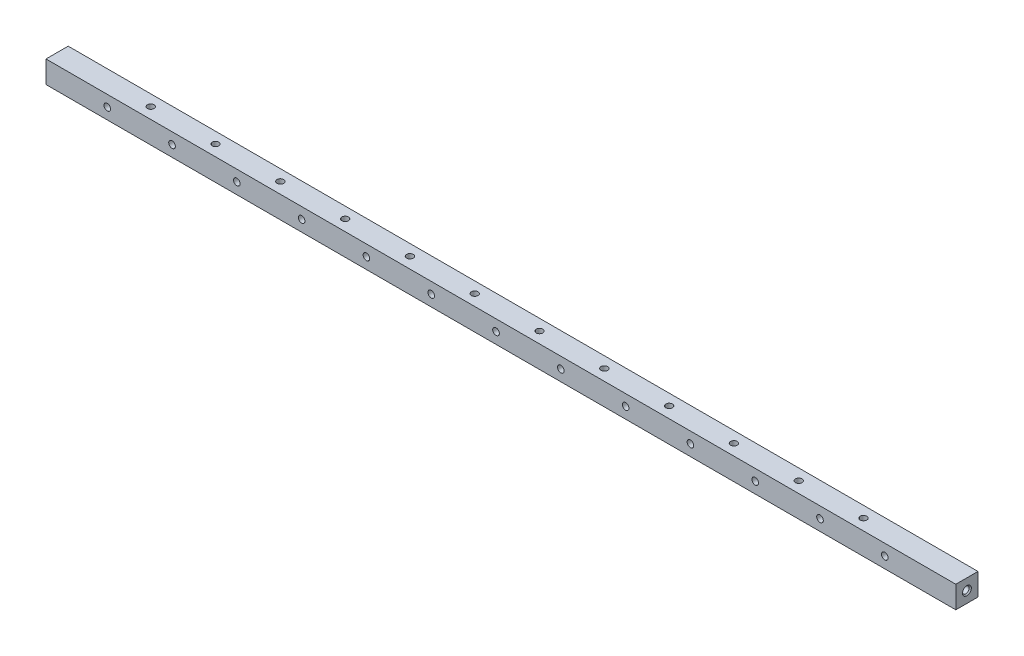
ISO-10303-21;
HEADER;
FILE_DESCRIPTION(('STEP AP214'),'2;1');
FILE_NAME('part.step','',(''),(''),'','','');
FILE_SCHEMA(('AUTOMOTIVE_DESIGN { 1 0 10303 214 1 1 1 1 }'));
ENDSEC;
DATA;
#1=APPLICATION_CONTEXT('core data for automotive mechanical design processes');
#2=APPLICATION_PROTOCOL_DEFINITION('international standard','automotive_design',2000,#1);
#3=PRODUCT_CONTEXT('',#1,'mechanical');
#4=PRODUCT('Part','Part','',(#3));
#5=PRODUCT_RELATED_PRODUCT_CATEGORY('part','',(#4));
#6=PRODUCT_DEFINITION_FORMATION('','',#4);
#7=PRODUCT_DEFINITION_CONTEXT('part definition',#1,'design');
#8=PRODUCT_DEFINITION('design','',#6,#7);
#9=PRODUCT_DEFINITION_SHAPE('','',#8);
#10=(LENGTH_UNIT() NAMED_UNIT(*) SI_UNIT(.MILLI.,.METRE.));
#11=(NAMED_UNIT(*) PLANE_ANGLE_UNIT() SI_UNIT($,.RADIAN.));
#12=(NAMED_UNIT(*) SI_UNIT($,.STERADIAN.) SOLID_ANGLE_UNIT());
#13=UNCERTAINTY_MEASURE_WITH_UNIT(LENGTH_MEASURE(1.E-05),#10,'distance_accuracy_value','');
#14=(GEOMETRIC_REPRESENTATION_CONTEXT(3) GLOBAL_UNCERTAINTY_ASSIGNED_CONTEXT((#13)) GLOBAL_UNIT_ASSIGNED_CONTEXT((#10,
#11,#12)) REPRESENTATION_CONTEXT('',''));
#15=CARTESIAN_POINT('',(0.,0.,0.));
#16=DIRECTION('',(0.,0.,1.));
#17=DIRECTION('',(1.,0.,0.));
#18=AXIS2_PLACEMENT_3D('',#15,#16,#17);
#19=CARTESIAN_POINT('',(520.7,6.35,-6.35));
#20=DIRECTION('',(0.,-1.,0.));
#21=DIRECTION('',(0.,0.,-1.));
#22=AXIS2_PLACEMENT_3D('',#19,#20,#21);
#23=PLANE('',#22);
#24=CARTESIAN_POINT('',(461.518,6.35,0.));
#25=DIRECTION('',(0.,1.,0.));
#26=DIRECTION('',(0.,0.,1.));
#27=AXIS2_PLACEMENT_3D('',#24,#25,#26);
#28=CIRCLE('',#27,1.89865);
#29=CARTESIAN_POINT('',(461.518,6.35,1.89865));
#30=VERTEX_POINT('',#29);
#31=EDGE_CURVE('E709',#30,#30,#28,.T.);
#32=ORIENTED_EDGE('',*,*,#31,.F.);
#33=EDGE_LOOP('',(#32));
#34=FACE_BOUND('',#33,.T.);
#35=CARTESIAN_POINT('',(387.35,6.35,0.));
#36=DIRECTION('',(0.,1.,0.));
#37=DIRECTION('',(0.,0.,1.));
#38=AXIS2_PLACEMENT_3D('',#35,#36,#37);
#39=CIRCLE('',#38,1.89865);
#40=CARTESIAN_POINT('',(387.35,6.35,1.89865));
#41=VERTEX_POINT('',#40);
#42=EDGE_CURVE('E705',#41,#41,#39,.T.);
#43=ORIENTED_EDGE('',*,*,#42,.F.);
#44=EDGE_LOOP('',(#43));
#45=FACE_BOUND('',#44,.T.);
#46=CARTESIAN_POINT('',(350.266,6.35,0.));
#47=DIRECTION('',(0.,1.,0.));
#48=DIRECTION('',(0.,0.,1.));
#49=AXIS2_PLACEMENT_3D('',#46,#47,#48);
#50=CIRCLE('',#49,1.89865);
#51=CARTESIAN_POINT('',(350.266,6.35,1.89865));
#52=VERTEX_POINT('',#51);
#53=EDGE_CURVE('E719',#52,#52,#50,.T.);
#54=ORIENTED_EDGE('',*,*,#53,.F.);
#55=EDGE_LOOP('',(#54));
#56=FACE_BOUND('',#55,.T.);
#57=CARTESIAN_POINT('',(313.182,6.35,0.));
#58=DIRECTION('',(0.,1.,0.));
#59=DIRECTION('',(0.,0.,1.));
#60=AXIS2_PLACEMENT_3D('',#57,#58,#59);
#61=CIRCLE('',#60,1.89865);
#62=CARTESIAN_POINT('',(313.182,6.35,1.89865));
#63=VERTEX_POINT('',#62);
#64=EDGE_CURVE('E727',#63,#63,#61,.T.);
#65=ORIENTED_EDGE('',*,*,#64,.F.);
#66=EDGE_LOOP('',(#65));
#67=FACE_BOUND('',#66,.T.);
#68=CARTESIAN_POINT('',(239.014,6.35,0.));
#69=DIRECTION('',(0.,1.,0.));
#70=DIRECTION('',(0.,0.,1.));
#71=AXIS2_PLACEMENT_3D('',#68,#69,#70);
#72=CIRCLE('',#71,1.89865);
#73=CARTESIAN_POINT('',(239.014,6.35,1.89865));
#74=VERTEX_POINT('',#73);
#75=EDGE_CURVE('E741',#74,#74,#72,.T.);
#76=ORIENTED_EDGE('',*,*,#75,.F.);
#77=EDGE_LOOP('',(#76));
#78=FACE_BOUND('',#77,.T.);
#79=CARTESIAN_POINT('',(201.93,6.35,0.));
#80=DIRECTION('',(0.,1.,0.));
#81=DIRECTION('',(0.,0.,1.));
#82=AXIS2_PLACEMENT_3D('',#79,#80,#81);
#83=CIRCLE('',#82,1.89865);
#84=CARTESIAN_POINT('',(201.93,6.35,1.89865));
#85=VERTEX_POINT('',#84);
#86=EDGE_CURVE('E749',#85,#85,#83,.T.);
#87=ORIENTED_EDGE('',*,*,#86,.F.);
#88=EDGE_LOOP('',(#87));
#89=FACE_BOUND('',#88,.T.);
#90=CARTESIAN_POINT('',(164.846,6.35,0.));
#91=DIRECTION('',(0.,1.,0.));
#92=DIRECTION('',(0.,0.,1.));
#93=AXIS2_PLACEMENT_3D('',#90,#91,#92);
#94=CIRCLE('',#93,1.89865);
#95=CARTESIAN_POINT('',(164.846,6.35,1.89865));
#96=VERTEX_POINT('',#95);
#97=EDGE_CURVE('E757',#96,#96,#94,.T.);
#98=ORIENTED_EDGE('',*,*,#97,.F.);
#99=EDGE_LOOP('',(#98));
#100=FACE_BOUND('',#99,.T.);
#101=CARTESIAN_POINT('',(127.762,6.35,0.));
#102=DIRECTION('',(0.,1.,0.));
#103=DIRECTION('',(0.,0.,1.));
#104=AXIS2_PLACEMENT_3D('',#101,#102,#103);
#105=CIRCLE('',#104,1.89865);
#106=CARTESIAN_POINT('',(127.762,6.35,1.89865));
#107=VERTEX_POINT('',#106);
#108=EDGE_CURVE('E765',#107,#107,#105,.T.);
#109=ORIENTED_EDGE('',*,*,#108,.F.);
#110=EDGE_LOOP('',(#109));
#111=FACE_BOUND('',#110,.T.);
#112=CARTESIAN_POINT('',(90.678,6.35,0.));
#113=DIRECTION('',(0.,1.,0.));
#114=DIRECTION('',(0.,0.,1.));
#115=AXIS2_PLACEMENT_3D('',#112,#113,#114);
#116=CIRCLE('',#115,1.89864999999999);
#117=CARTESIAN_POINT('',(90.678,6.35,1.89864999999999));
#118=VERTEX_POINT('',#117);
#119=EDGE_CURVE('E773',#118,#118,#116,.T.);
#120=ORIENTED_EDGE('',*,*,#119,.F.);
#121=EDGE_LOOP('',(#120));
#122=FACE_BOUND('',#121,.T.);
#123=CARTESIAN_POINT('',(53.594,6.35,0.));
#124=DIRECTION('',(0.,1.,0.));
#125=DIRECTION('',(0.,0.,1.));
#126=AXIS2_PLACEMENT_3D('',#123,#124,#125);
#127=CIRCLE('',#126,1.89864999999999);
#128=CARTESIAN_POINT('',(53.594,6.35,1.89864999999999));
#129=VERTEX_POINT('',#128);
#130=EDGE_CURVE('E138',#129,#129,#127,.T.);
#131=ORIENTED_EDGE('',*,*,#130,.F.);
#132=EDGE_LOOP('',(#131));
#133=FACE_BOUND('',#132,.T.);
#134=DIRECTION('',(0.,0.,1.));
#135=VECTOR('',#134,1.);
#136=CARTESIAN_POINT('',(0.,6.35,-6.35));
#137=LINE('',#136,#135);
#138=CARTESIAN_POINT('',(0.,6.35,-6.35));
#139=VERTEX_POINT('',#138);
#140=CARTESIAN_POINT('',(0.,6.35,6.35));
#141=VERTEX_POINT('',#140);
#142=EDGE_CURVE('E90',#139,#141,#137,.T.);
#143=ORIENTED_EDGE('',*,*,#142,.T.);
#144=DIRECTION('',(-1.,0.,0.));
#145=VECTOR('',#144,1.);
#146=CARTESIAN_POINT('',(520.7,6.35,6.35));
#147=LINE('',#146,#145);
#148=CARTESIAN_POINT('',(520.7,6.35,6.35));
#149=VERTEX_POINT('',#148);
#150=EDGE_CURVE('E164',#149,#141,#147,.T.);
#151=ORIENTED_EDGE('',*,*,#150,.F.);
#152=DIRECTION('',(0.,0.,1.));
#153=VECTOR('',#152,1.);
#154=CARTESIAN_POINT('',(520.7,6.35,-6.35));
#155=LINE('',#154,#153);
#156=CARTESIAN_POINT('',(520.7,6.35,-6.35));
#157=VERTEX_POINT('',#156);
#158=EDGE_CURVE('E63',#157,#149,#155,.T.);
#159=ORIENTED_EDGE('',*,*,#158,.F.);
#160=DIRECTION('',(-1.,0.,0.));
#161=VECTOR('',#160,1.);
#162=CARTESIAN_POINT('',(520.7,6.35,-6.35));
#163=LINE('',#162,#161);
#164=EDGE_CURVE('E176',#157,#139,#163,.T.);
#165=ORIENTED_EDGE('',*,*,#164,.T.);
#166=EDGE_LOOP('',(#143,#151,#159,#165));
#167=FACE_BOUND('',#166,.T.);
#168=CARTESIAN_POINT('',(276.098,6.35,0.));
#169=DIRECTION('',(0.,1.,0.));
#170=DIRECTION('',(0.,0.,1.));
#171=AXIS2_PLACEMENT_3D('',#168,#169,#170);
#172=CIRCLE('',#171,1.89865);
#173=CARTESIAN_POINT('',(276.098,6.35,1.89865));
#174=VERTEX_POINT('',#173);
#175=EDGE_CURVE('E693',#174,#174,#172,.T.);
#176=ORIENTED_EDGE('',*,*,#175,.F.);
#177=EDGE_LOOP('',(#176));
#178=FACE_BOUND('',#177,.T.);
#179=CARTESIAN_POINT('',(424.434,6.35,0.));
#180=DIRECTION('',(0.,1.,0.));
#181=DIRECTION('',(0.,0.,1.));
#182=AXIS2_PLACEMENT_3D('',#179,#180,#181);
#183=CIRCLE('',#182,1.89865);
#184=CARTESIAN_POINT('',(424.434,6.35,1.89865));
#185=VERTEX_POINT('',#184);
#186=EDGE_CURVE('E696',#185,#185,#183,.T.);
#187=ORIENTED_EDGE('',*,*,#186,.F.);
#188=EDGE_LOOP('',(#187));
#189=FACE_BOUND('',#188,.T.);
#190=ADVANCED_FACE('F42',(#34,#45,#56,#67,#78,#89,#100,#111,#122,#133,#167,#178,#189),#23,.F.);
#191=CARTESIAN_POINT('',(480.06,0.,6.35));
#192=DIRECTION('',(0.,0.,1.));
#193=DIRECTION('',(1.,0.,0.));
#194=AXIS2_PLACEMENT_3D('',#191,#192,#193);
#195=CYLINDRICAL_SURFACE('',#194,1.89864999999999);
#196=CARTESIAN_POINT('',(480.06,0.,-6.35));
#197=DIRECTION('',(0.,0.,1.));
#198=DIRECTION('',(1.,0.,0.));
#199=AXIS2_PLACEMENT_3D('',#196,#197,#198);
#200=CIRCLE('',#199,1.89864999999999);
#201=CARTESIAN_POINT('',(481.95865,0.,-6.35));
#202=VERTEX_POINT('',#201);
#203=EDGE_CURVE('E52',#202,#202,#200,.T.);
#204=ORIENTED_EDGE('',*,*,#203,.F.);
#205=EDGE_LOOP('',(#204));
#206=FACE_BOUND('',#205,.T.);
#207=CARTESIAN_POINT('',(480.06,0.,6.35));
#208=DIRECTION('',(0.,0.,1.));
#209=DIRECTION('',(1.,0.,0.));
#210=AXIS2_PLACEMENT_3D('',#207,#208,#209);
#211=CIRCLE('',#210,1.89864999999999);
#212=CARTESIAN_POINT('',(481.95865,0.,6.35));
#213=VERTEX_POINT('',#212);
#214=EDGE_CURVE('E11',#213,#213,#211,.T.);
#215=ORIENTED_EDGE('',*,*,#214,.T.);
#216=EDGE_LOOP('',(#215));
#217=FACE_BOUND('',#216,.T.);
#218=ADVANCED_FACE('F44',(#206,#217),#195,.F.);
#219=CARTESIAN_POINT('',(442.976,0.,6.35));
#220=DIRECTION('',(0.,0.,1.));
#221=DIRECTION('',(1.,0.,0.));
#222=AXIS2_PLACEMENT_3D('',#219,#220,#221);
#223=CYLINDRICAL_SURFACE('',#222,1.89864999999999);
#224=CARTESIAN_POINT('',(442.976,0.,-6.35));
#225=DIRECTION('',(0.,0.,1.));
#226=DIRECTION('',(1.,0.,0.));
#227=AXIS2_PLACEMENT_3D('',#224,#225,#226);
#228=CIRCLE('',#227,1.89864999999999);
#229=CARTESIAN_POINT('',(444.87465,0.,-6.35));
#230=VERTEX_POINT('',#229);
#231=EDGE_CURVE('E256',#230,#230,#228,.T.);
#232=ORIENTED_EDGE('',*,*,#231,.F.);
#233=EDGE_LOOP('',(#232));
#234=FACE_BOUND('',#233,.T.);
#235=CARTESIAN_POINT('',(442.976,0.,6.35));
#236=DIRECTION('',(0.,0.,1.));
#237=DIRECTION('',(1.,0.,0.));
#238=AXIS2_PLACEMENT_3D('',#235,#236,#237);
#239=CIRCLE('',#238,1.89864999999999);
#240=CARTESIAN_POINT('',(444.87465,0.,6.35));
#241=VERTEX_POINT('',#240);
#242=EDGE_CURVE('E260',#241,#241,#239,.T.);
#243=ORIENTED_EDGE('',*,*,#242,.T.);
#244=EDGE_LOOP('',(#243));
#245=FACE_BOUND('',#244,.T.);
#246=ADVANCED_FACE('F272',(#234,#245),#223,.F.);
#247=CARTESIAN_POINT('',(405.892,0.,6.35));
#248=DIRECTION('',(0.,0.,1.));
#249=DIRECTION('',(1.,0.,0.));
#250=AXIS2_PLACEMENT_3D('',#247,#248,#249);
#251=CYLINDRICAL_SURFACE('',#250,1.89864999999999);
#252=CARTESIAN_POINT('',(405.892,0.,-6.35));
#253=DIRECTION('',(0.,0.,1.));
#254=DIRECTION('',(1.,0.,0.));
#255=AXIS2_PLACEMENT_3D('',#252,#253,#254);
#256=CIRCLE('',#255,1.89864999999999);
#257=CARTESIAN_POINT('',(407.79065,0.,-6.35));
#258=VERTEX_POINT('',#257);
#259=EDGE_CURVE('E248',#258,#258,#256,.T.);
#260=ORIENTED_EDGE('',*,*,#259,.F.);
#261=EDGE_LOOP('',(#260));
#262=FACE_BOUND('',#261,.T.);
#263=CARTESIAN_POINT('',(405.892,0.,6.35));
#264=DIRECTION('',(0.,0.,1.));
#265=DIRECTION('',(1.,0.,0.));
#266=AXIS2_PLACEMENT_3D('',#263,#264,#265);
#267=CIRCLE('',#266,1.89864999999999);
#268=CARTESIAN_POINT('',(407.79065,0.,6.35));
#269=VERTEX_POINT('',#268);
#270=EDGE_CURVE('E252',#269,#269,#267,.T.);
#271=ORIENTED_EDGE('',*,*,#270,.T.);
#272=EDGE_LOOP('',(#271));
#273=FACE_BOUND('',#272,.T.);
#274=ADVANCED_FACE('F338',(#262,#273),#251,.F.);
#275=CARTESIAN_POINT('',(368.808,0.,6.35));
#276=DIRECTION('',(0.,0.,1.));
#277=DIRECTION('',(1.,0.,0.));
#278=AXIS2_PLACEMENT_3D('',#275,#276,#277);
#279=CYLINDRICAL_SURFACE('',#278,1.89864999999999);
#280=CARTESIAN_POINT('',(368.808,0.,-6.35));
#281=DIRECTION('',(0.,0.,1.));
#282=DIRECTION('',(1.,0.,0.));
#283=AXIS2_PLACEMENT_3D('',#280,#281,#282);
#284=CIRCLE('',#283,1.89864999999999);
#285=CARTESIAN_POINT('',(370.70665,0.,-6.35));
#286=VERTEX_POINT('',#285);
#287=EDGE_CURVE('E240',#286,#286,#284,.T.);
#288=ORIENTED_EDGE('',*,*,#287,.F.);
#289=EDGE_LOOP('',(#288));
#290=FACE_BOUND('',#289,.T.);
#291=CARTESIAN_POINT('',(368.808,0.,6.35));
#292=DIRECTION('',(0.,0.,1.));
#293=DIRECTION('',(1.,0.,0.));
#294=AXIS2_PLACEMENT_3D('',#291,#292,#293);
#295=CIRCLE('',#294,1.89864999999999);
#296=CARTESIAN_POINT('',(370.70665,0.,6.35));
#297=VERTEX_POINT('',#296);
#298=EDGE_CURVE('E244',#297,#297,#295,.T.);
#299=ORIENTED_EDGE('',*,*,#298,.T.);
#300=EDGE_LOOP('',(#299));
#301=FACE_BOUND('',#300,.T.);
#302=ADVANCED_FACE('F344',(#290,#301),#279,.F.);
#303=CARTESIAN_POINT('',(331.724,0.,6.35));
#304=DIRECTION('',(0.,0.,1.));
#305=DIRECTION('',(1.,0.,0.));
#306=AXIS2_PLACEMENT_3D('',#303,#304,#305);
#307=CYLINDRICAL_SURFACE('',#306,1.89864999999999);
#308=CARTESIAN_POINT('',(331.724,0.,-6.35));
#309=DIRECTION('',(0.,0.,1.));
#310=DIRECTION('',(1.,0.,0.));
#311=AXIS2_PLACEMENT_3D('',#308,#309,#310);
#312=CIRCLE('',#311,1.89864999999999);
#313=CARTESIAN_POINT('',(333.62265,0.,-6.35));
#314=VERTEX_POINT('',#313);
#315=EDGE_CURVE('E232',#314,#314,#312,.T.);
#316=ORIENTED_EDGE('',*,*,#315,.F.);
#317=EDGE_LOOP('',(#316));
#318=FACE_BOUND('',#317,.T.);
#319=CARTESIAN_POINT('',(331.724,0.,6.35));
#320=DIRECTION('',(0.,0.,1.));
#321=DIRECTION('',(1.,0.,0.));
#322=AXIS2_PLACEMENT_3D('',#319,#320,#321);
#323=CIRCLE('',#322,1.89864999999999);
#324=CARTESIAN_POINT('',(333.62265,0.,6.35));
#325=VERTEX_POINT('',#324);
#326=EDGE_CURVE('E236',#325,#325,#323,.T.);
#327=ORIENTED_EDGE('',*,*,#326,.T.);
#328=EDGE_LOOP('',(#327));
#329=FACE_BOUND('',#328,.T.);
#330=ADVANCED_FACE('F350',(#318,#329),#307,.F.);
#331=CARTESIAN_POINT('',(294.64,0.,6.35));
#332=DIRECTION('',(0.,0.,1.));
#333=DIRECTION('',(1.,0.,0.));
#334=AXIS2_PLACEMENT_3D('',#331,#332,#333);
#335=CYLINDRICAL_SURFACE('',#334,1.89864999999999);
#336=CARTESIAN_POINT('',(294.64,0.,-6.35));
#337=DIRECTION('',(0.,0.,1.));
#338=DIRECTION('',(1.,0.,0.));
#339=AXIS2_PLACEMENT_3D('',#336,#337,#338);
#340=CIRCLE('',#339,1.89864999999999);
#341=CARTESIAN_POINT('',(296.53865,0.,-6.35));
#342=VERTEX_POINT('',#341);
#343=EDGE_CURVE('E224',#342,#342,#340,.T.);
#344=ORIENTED_EDGE('',*,*,#343,.F.);
#345=EDGE_LOOP('',(#344));
#346=FACE_BOUND('',#345,.T.);
#347=CARTESIAN_POINT('',(294.64,0.,6.35));
#348=DIRECTION('',(0.,0.,1.));
#349=DIRECTION('',(1.,0.,0.));
#350=AXIS2_PLACEMENT_3D('',#347,#348,#349);
#351=CIRCLE('',#350,1.89864999999999);
#352=CARTESIAN_POINT('',(296.53865,0.,6.35));
#353=VERTEX_POINT('',#352);
#354=EDGE_CURVE('E228',#353,#353,#351,.T.);
#355=ORIENTED_EDGE('',*,*,#354,.T.);
#356=EDGE_LOOP('',(#355));
#357=FACE_BOUND('',#356,.T.);
#358=ADVANCED_FACE('F354',(#346,#357),#335,.F.);
#359=CARTESIAN_POINT('',(257.556,0.,6.35));
#360=DIRECTION('',(0.,0.,1.));
#361=DIRECTION('',(1.,0.,0.));
#362=AXIS2_PLACEMENT_3D('',#359,#360,#361);
#363=CYLINDRICAL_SURFACE('',#362,1.89864999999999);
#364=CARTESIAN_POINT('',(257.556,0.,-6.35));
#365=DIRECTION('',(0.,0.,1.));
#366=DIRECTION('',(1.,0.,0.));
#367=AXIS2_PLACEMENT_3D('',#364,#365,#366);
#368=CIRCLE('',#367,1.89864999999999);
#369=CARTESIAN_POINT('',(259.45465,0.,-6.35));
#370=VERTEX_POINT('',#369);
#371=EDGE_CURVE('E216',#370,#370,#368,.T.);
#372=ORIENTED_EDGE('',*,*,#371,.F.);
#373=EDGE_LOOP('',(#372));
#374=FACE_BOUND('',#373,.T.);
#375=CARTESIAN_POINT('',(257.556,0.,6.35));
#376=DIRECTION('',(0.,0.,1.));
#377=DIRECTION('',(1.,0.,0.));
#378=AXIS2_PLACEMENT_3D('',#375,#376,#377);
#379=CIRCLE('',#378,1.89864999999999);
#380=CARTESIAN_POINT('',(259.45465,0.,6.35));
#381=VERTEX_POINT('',#380);
#382=EDGE_CURVE('E220',#381,#381,#379,.T.);
#383=ORIENTED_EDGE('',*,*,#382,.T.);
#384=EDGE_LOOP('',(#383));
#385=FACE_BOUND('',#384,.T.);
#386=ADVANCED_FACE('F358',(#374,#385),#363,.F.);
#387=CARTESIAN_POINT('',(220.472,0.,6.35));
#388=DIRECTION('',(0.,0.,1.));
#389=DIRECTION('',(1.,0.,0.));
#390=AXIS2_PLACEMENT_3D('',#387,#388,#389);
#391=CYLINDRICAL_SURFACE('',#390,1.89864999999999);
#392=CARTESIAN_POINT('',(220.472,0.,-6.35));
#393=DIRECTION('',(0.,0.,1.));
#394=DIRECTION('',(1.,0.,0.));
#395=AXIS2_PLACEMENT_3D('',#392,#393,#394);
#396=CIRCLE('',#395,1.89864999999999);
#397=CARTESIAN_POINT('',(222.37065,0.,-6.35));
#398=VERTEX_POINT('',#397);
#399=EDGE_CURVE('E208',#398,#398,#396,.T.);
#400=ORIENTED_EDGE('',*,*,#399,.F.);
#401=EDGE_LOOP('',(#400));
#402=FACE_BOUND('',#401,.T.);
#403=CARTESIAN_POINT('',(220.472,0.,6.35));
#404=DIRECTION('',(0.,0.,1.));
#405=DIRECTION('',(1.,0.,0.));
#406=AXIS2_PLACEMENT_3D('',#403,#404,#405);
#407=CIRCLE('',#406,1.89864999999999);
#408=CARTESIAN_POINT('',(222.37065,0.,6.35));
#409=VERTEX_POINT('',#408);
#410=EDGE_CURVE('E212',#409,#409,#407,.T.);
#411=ORIENTED_EDGE('',*,*,#410,.T.);
#412=EDGE_LOOP('',(#411));
#413=FACE_BOUND('',#412,.T.);
#414=ADVANCED_FACE('F362',(#402,#413),#391,.F.);
#415=CARTESIAN_POINT('',(183.388,0.,6.35));
#416=DIRECTION('',(0.,0.,1.));
#417=DIRECTION('',(1.,0.,0.));
#418=AXIS2_PLACEMENT_3D('',#415,#416,#417);
#419=CYLINDRICAL_SURFACE('',#418,1.89864999999999);
#420=CARTESIAN_POINT('',(183.388,0.,-6.35));
#421=DIRECTION('',(0.,0.,1.));
#422=DIRECTION('',(1.,0.,0.));
#423=AXIS2_PLACEMENT_3D('',#420,#421,#422);
#424=CIRCLE('',#423,1.89864999999999);
#425=CARTESIAN_POINT('',(185.28665,0.,-6.35));
#426=VERTEX_POINT('',#425);
#427=EDGE_CURVE('E200',#426,#426,#424,.T.);
#428=ORIENTED_EDGE('',*,*,#427,.F.);
#429=EDGE_LOOP('',(#428));
#430=FACE_BOUND('',#429,.T.);
#431=CARTESIAN_POINT('',(183.388,0.,6.35));
#432=DIRECTION('',(0.,0.,1.));
#433=DIRECTION('',(1.,0.,0.));
#434=AXIS2_PLACEMENT_3D('',#431,#432,#433);
#435=CIRCLE('',#434,1.89864999999999);
#436=CARTESIAN_POINT('',(185.28665,0.,6.35));
#437=VERTEX_POINT('',#436);
#438=EDGE_CURVE('E204',#437,#437,#435,.T.);
#439=ORIENTED_EDGE('',*,*,#438,.T.);
#440=EDGE_LOOP('',(#439));
#441=FACE_BOUND('',#440,.T.);
#442=ADVANCED_FACE('F366',(#430,#441),#419,.F.);
#443=CARTESIAN_POINT('',(146.304,0.,6.35));
#444=DIRECTION('',(0.,0.,1.));
#445=DIRECTION('',(1.,0.,0.));
#446=AXIS2_PLACEMENT_3D('',#443,#444,#445);
#447=CYLINDRICAL_SURFACE('',#446,1.89864999999999);
#448=CARTESIAN_POINT('',(146.304,0.,-6.35));
#449=DIRECTION('',(0.,0.,1.));
#450=DIRECTION('',(1.,0.,0.));
#451=AXIS2_PLACEMENT_3D('',#448,#449,#450);
#452=CIRCLE('',#451,1.89864999999999);
#453=CARTESIAN_POINT('',(148.20265,0.,-6.35));
#454=VERTEX_POINT('',#453);
#455=EDGE_CURVE('E192',#454,#454,#452,.T.);
#456=ORIENTED_EDGE('',*,*,#455,.F.);
#457=EDGE_LOOP('',(#456));
#458=FACE_BOUND('',#457,.T.);
#459=CARTESIAN_POINT('',(146.304,0.,6.35));
#460=DIRECTION('',(0.,0.,1.));
#461=DIRECTION('',(1.,0.,0.));
#462=AXIS2_PLACEMENT_3D('',#459,#460,#461);
#463=CIRCLE('',#462,1.89864999999999);
#464=CARTESIAN_POINT('',(148.20265,0.,6.35));
#465=VERTEX_POINT('',#464);
#466=EDGE_CURVE('E196',#465,#465,#463,.T.);
#467=ORIENTED_EDGE('',*,*,#466,.T.);
#468=EDGE_LOOP('',(#467));
#469=FACE_BOUND('',#468,.T.);
#470=ADVANCED_FACE('F287',(#458,#469),#447,.F.);
#471=CARTESIAN_POINT('',(109.22,0.,6.35));
#472=DIRECTION('',(0.,0.,1.));
#473=DIRECTION('',(1.,0.,0.));
#474=AXIS2_PLACEMENT_3D('',#471,#472,#473);
#475=CYLINDRICAL_SURFACE('',#474,1.89864999999999);
#476=CARTESIAN_POINT('',(109.22,0.,-6.35));
#477=DIRECTION('',(0.,0.,1.));
#478=DIRECTION('',(1.,0.,0.));
#479=AXIS2_PLACEMENT_3D('',#476,#477,#478);
#480=CIRCLE('',#479,1.89864999999999);
#481=CARTESIAN_POINT('',(111.11865,0.,-6.35));
#482=VERTEX_POINT('',#481);
#483=EDGE_CURVE('E184',#482,#482,#480,.T.);
#484=ORIENTED_EDGE('',*,*,#483,.F.);
#485=EDGE_LOOP('',(#484));
#486=FACE_BOUND('',#485,.T.);
#487=CARTESIAN_POINT('',(109.22,0.,6.35));
#488=DIRECTION('',(0.,0.,1.));
#489=DIRECTION('',(1.,0.,0.));
#490=AXIS2_PLACEMENT_3D('',#487,#488,#489);
#491=CIRCLE('',#490,1.89864999999999);
#492=CARTESIAN_POINT('',(111.11865,0.,6.35));
#493=VERTEX_POINT('',#492);
#494=EDGE_CURVE('E188',#493,#493,#491,.T.);
#495=ORIENTED_EDGE('',*,*,#494,.T.);
#496=EDGE_LOOP('',(#495));
#497=FACE_BOUND('',#496,.T.);
#498=ADVANCED_FACE('F278',(#486,#497),#475,.F.);
#499=CARTESIAN_POINT('',(520.7,-6.35,6.35));
#500=DIRECTION('',(0.,0.,-1.));
#501=DIRECTION('',(-1.,0.,0.));
#502=AXIS2_PLACEMENT_3D('',#499,#500,#501);
#503=PLANE('',#502);
#504=CARTESIAN_POINT('',(72.136,0.,6.35));
#505=DIRECTION('',(0.,0.,1.));
#506=DIRECTION('',(1.,0.,0.));
#507=AXIS2_PLACEMENT_3D('',#504,#505,#506);
#508=CIRCLE('',#507,1.89864999999999);
#509=CARTESIAN_POINT('',(74.03465,0.,6.35));
#510=VERTEX_POINT('',#509);
#511=EDGE_CURVE('E783',#510,#510,#508,.T.);
#512=ORIENTED_EDGE('',*,*,#511,.F.);
#513=EDGE_LOOP('',(#512));
#514=FACE_BOUND('',#513,.T.);
#515=CARTESIAN_POINT('',(35.052,0.,6.35));
#516=DIRECTION('',(0.,0.,1.));
#517=DIRECTION('',(1.,0.,0.));
#518=AXIS2_PLACEMENT_3D('',#515,#516,#517);
#519=CIRCLE('',#518,1.89864999999999);
#520=CARTESIAN_POINT('',(36.95065,0.,6.35));
#521=VERTEX_POINT('',#520);
#522=EDGE_CURVE('E146',#521,#521,#519,.T.);
#523=ORIENTED_EDGE('',*,*,#522,.F.);
#524=EDGE_LOOP('',(#523));
#525=FACE_BOUND('',#524,.T.);
#526=DIRECTION('',(0.,-1.,0.));
#527=VECTOR('',#526,1.);
#528=CARTESIAN_POINT('',(0.,-6.35,6.35));
#529=LINE('',#528,#527);
#530=CARTESIAN_POINT('',(0.,-6.35,6.35));
#531=VERTEX_POINT('',#530);
#532=EDGE_CURVE('E154',#141,#531,#529,.T.);
#533=ORIENTED_EDGE('',*,*,#532,.T.);
#534=DIRECTION('',(-1.,0.,0.));
#535=VECTOR('',#534,1.);
#536=CARTESIAN_POINT('',(520.7,-6.35,6.35));
#537=LINE('',#536,#535);
#538=CARTESIAN_POINT('',(520.7,-6.35,6.35));
#539=VERTEX_POINT('',#538);
#540=EDGE_CURVE('E182',#539,#531,#537,.T.);
#541=ORIENTED_EDGE('',*,*,#540,.F.);
#542=DIRECTION('',(0.,-1.,0.));
#543=VECTOR('',#542,1.);
#544=CARTESIAN_POINT('',(520.7,-6.35,6.35));
#545=LINE('',#544,#543);
#546=EDGE_CURVE('E155',#149,#539,#545,.T.);
#547=ORIENTED_EDGE('',*,*,#546,.F.);
#548=ORIENTED_EDGE('',*,*,#150,.T.);
#549=EDGE_LOOP('',(#533,#541,#547,#548));
#550=FACE_BOUND('',#549,.T.);
#551=ORIENTED_EDGE('',*,*,#494,.F.);
#552=EDGE_LOOP('',(#551));
#553=FACE_BOUND('',#552,.T.);
#554=ORIENTED_EDGE('',*,*,#466,.F.);
#555=EDGE_LOOP('',(#554));
#556=FACE_BOUND('',#555,.T.);
#557=ORIENTED_EDGE('',*,*,#438,.F.);
#558=EDGE_LOOP('',(#557));
#559=FACE_BOUND('',#558,.T.);
#560=ORIENTED_EDGE('',*,*,#410,.F.);
#561=EDGE_LOOP('',(#560));
#562=FACE_BOUND('',#561,.T.);
#563=ORIENTED_EDGE('',*,*,#382,.F.);
#564=EDGE_LOOP('',(#563));
#565=FACE_BOUND('',#564,.T.);
#566=ORIENTED_EDGE('',*,*,#354,.F.);
#567=EDGE_LOOP('',(#566));
#568=FACE_BOUND('',#567,.T.);
#569=ORIENTED_EDGE('',*,*,#326,.F.);
#570=EDGE_LOOP('',(#569));
#571=FACE_BOUND('',#570,.T.);
#572=ORIENTED_EDGE('',*,*,#298,.F.);
#573=EDGE_LOOP('',(#572));
#574=FACE_BOUND('',#573,.T.);
#575=ORIENTED_EDGE('',*,*,#270,.F.);
#576=EDGE_LOOP('',(#575));
#577=FACE_BOUND('',#576,.T.);
#578=ORIENTED_EDGE('',*,*,#242,.F.);
#579=EDGE_LOOP('',(#578));
#580=FACE_BOUND('',#579,.T.);
#581=ORIENTED_EDGE('',*,*,#214,.F.);
#582=EDGE_LOOP('',(#581));
#583=FACE_BOUND('',#582,.T.);
#584=ADVANCED_FACE('F275',(#514,#525,#550,#553,#556,#559,#562,#565,#568,#571,#574,#577,#580,
#583),#503,.F.);
#585=CARTESIAN_POINT('',(520.7,-6.35,-6.35));
#586=DIRECTION('',(0.,1.,0.));
#587=DIRECTION('',(0.,0.,1.));
#588=AXIS2_PLACEMENT_3D('',#585,#586,#587);
#589=PLANE('',#588);
#590=CARTESIAN_POINT('',(461.518,-6.35,0.));
#591=DIRECTION('',(0.,1.,0.));
#592=DIRECTION('',(0.,0.,1.));
#593=AXIS2_PLACEMENT_3D('',#590,#591,#592);
#594=CIRCLE('',#593,1.89865);
#595=CARTESIAN_POINT('',(461.518,-6.35,1.89865));
#596=VERTEX_POINT('',#595);
#597=EDGE_CURVE('E700',#596,#596,#594,.T.);
#598=ORIENTED_EDGE('',*,*,#597,.T.);
#599=EDGE_LOOP('',(#598));
#600=FACE_BOUND('',#599,.T.);
#601=CARTESIAN_POINT('',(424.434,-6.35,0.));
#602=DIRECTION('',(0.,1.,0.));
#603=DIRECTION('',(0.,0.,1.));
#604=AXIS2_PLACEMENT_3D('',#601,#602,#603);
#605=CIRCLE('',#604,1.89865);
#606=CARTESIAN_POINT('',(424.434,-6.35,1.89865));
#607=VERTEX_POINT('',#606);
#608=EDGE_CURVE('E699',#607,#607,#605,.T.);
#609=ORIENTED_EDGE('',*,*,#608,.T.);
#610=EDGE_LOOP('',(#609));
#611=FACE_BOUND('',#610,.T.);
#612=CARTESIAN_POINT('',(387.35,-6.35,0.));
#613=DIRECTION('',(0.,1.,0.));
#614=DIRECTION('',(0.,0.,1.));
#615=AXIS2_PLACEMENT_3D('',#612,#613,#614);
#616=CIRCLE('',#615,1.89865);
#617=CARTESIAN_POINT('',(387.35,-6.35,1.89865));
#618=VERTEX_POINT('',#617);
#619=EDGE_CURVE('E715',#618,#618,#616,.T.);
#620=ORIENTED_EDGE('',*,*,#619,.T.);
#621=EDGE_LOOP('',(#620));
#622=FACE_BOUND('',#621,.T.);
#623=CARTESIAN_POINT('',(350.266,-6.35,0.));
#624=DIRECTION('',(0.,1.,0.));
#625=DIRECTION('',(0.,0.,1.));
#626=AXIS2_PLACEMENT_3D('',#623,#624,#625);
#627=CIRCLE('',#626,1.89865);
#628=CARTESIAN_POINT('',(350.266,-6.35,1.89865));
#629=VERTEX_POINT('',#628);
#630=EDGE_CURVE('E723',#629,#629,#627,.T.);
#631=ORIENTED_EDGE('',*,*,#630,.T.);
#632=EDGE_LOOP('',(#631));
#633=FACE_BOUND('',#632,.T.);
#634=CARTESIAN_POINT('',(313.182,-6.35,0.));
#635=DIRECTION('',(0.,1.,0.));
#636=DIRECTION('',(0.,0.,1.));
#637=AXIS2_PLACEMENT_3D('',#634,#635,#636);
#638=CIRCLE('',#637,1.89865);
#639=CARTESIAN_POINT('',(313.182,-6.35,1.89865));
#640=VERTEX_POINT('',#639);
#641=EDGE_CURVE('E731',#640,#640,#638,.T.);
#642=ORIENTED_EDGE('',*,*,#641,.T.);
#643=EDGE_LOOP('',(#642));
#644=FACE_BOUND('',#643,.T.);
#645=CARTESIAN_POINT('',(276.098,-6.35,0.));
#646=DIRECTION('',(0.,1.,0.));
#647=DIRECTION('',(0.,0.,1.));
#648=AXIS2_PLACEMENT_3D('',#645,#646,#647);
#649=CIRCLE('',#648,1.89865);
#650=CARTESIAN_POINT('',(276.098,-6.35,1.89865));
#651=VERTEX_POINT('',#650);
#652=EDGE_CURVE('E737',#651,#651,#649,.T.);
#653=ORIENTED_EDGE('',*,*,#652,.T.);
#654=EDGE_LOOP('',(#653));
#655=FACE_BOUND('',#654,.T.);
#656=CARTESIAN_POINT('',(239.014,-6.35,0.));
#657=DIRECTION('',(0.,1.,0.));
#658=DIRECTION('',(0.,0.,1.));
#659=AXIS2_PLACEMENT_3D('',#656,#657,#658);
#660=CIRCLE('',#659,1.89865);
#661=CARTESIAN_POINT('',(239.014,-6.35,1.89865));
#662=VERTEX_POINT('',#661);
#663=EDGE_CURVE('E745',#662,#662,#660,.T.);
#664=ORIENTED_EDGE('',*,*,#663,.T.);
#665=EDGE_LOOP('',(#664));
#666=FACE_BOUND('',#665,.T.);
#667=CARTESIAN_POINT('',(201.93,-6.35,0.));
#668=DIRECTION('',(0.,1.,0.));
#669=DIRECTION('',(0.,0.,1.));
#670=AXIS2_PLACEMENT_3D('',#667,#668,#669);
#671=CIRCLE('',#670,1.89865);
#672=CARTESIAN_POINT('',(201.93,-6.35,1.89865));
#673=VERTEX_POINT('',#672);
#674=EDGE_CURVE('E753',#673,#673,#671,.T.);
#675=ORIENTED_EDGE('',*,*,#674,.T.);
#676=EDGE_LOOP('',(#675));
#677=FACE_BOUND('',#676,.T.);
#678=CARTESIAN_POINT('',(164.846,-6.35,0.));
#679=DIRECTION('',(0.,1.,0.));
#680=DIRECTION('',(0.,0.,1.));
#681=AXIS2_PLACEMENT_3D('',#678,#679,#680);
#682=CIRCLE('',#681,1.89865);
#683=CARTESIAN_POINT('',(164.846,-6.35,1.89865));
#684=VERTEX_POINT('',#683);
#685=EDGE_CURVE('E761',#684,#684,#682,.T.);
#686=ORIENTED_EDGE('',*,*,#685,.T.);
#687=EDGE_LOOP('',(#686));
#688=FACE_BOUND('',#687,.T.);
#689=CARTESIAN_POINT('',(127.762,-6.35,0.));
#690=DIRECTION('',(0.,1.,0.));
#691=DIRECTION('',(0.,0.,1.));
#692=AXIS2_PLACEMENT_3D('',#689,#690,#691);
#693=CIRCLE('',#692,1.89865);
#694=CARTESIAN_POINT('',(127.762,-6.35,1.89865));
#695=VERTEX_POINT('',#694);
#696=EDGE_CURVE('E769',#695,#695,#693,.T.);
#697=ORIENTED_EDGE('',*,*,#696,.T.);
#698=EDGE_LOOP('',(#697));
#699=FACE_BOUND('',#698,.T.);
#700=CARTESIAN_POINT('',(90.678,-6.35,0.));
#701=DIRECTION('',(0.,1.,0.));
#702=DIRECTION('',(0.,0.,1.));
#703=AXIS2_PLACEMENT_3D('',#700,#701,#702);
#704=CIRCLE('',#703,1.89865);
#705=CARTESIAN_POINT('',(90.678,-6.35,1.89865));
#706=VERTEX_POINT('',#705);
#707=EDGE_CURVE('E777',#706,#706,#704,.T.);
#708=ORIENTED_EDGE('',*,*,#707,.T.);
#709=EDGE_LOOP('',(#708));
#710=FACE_BOUND('',#709,.T.);
#711=CARTESIAN_POINT('',(53.594,-6.35,0.));
#712=DIRECTION('',(0.,1.,0.));
#713=DIRECTION('',(0.,0.,1.));
#714=AXIS2_PLACEMENT_3D('',#711,#712,#713);
#715=CIRCLE('',#714,1.89864999999999);
#716=CARTESIAN_POINT('',(53.594,-6.35,1.89864999999999));
#717=VERTEX_POINT('',#716);
#718=EDGE_CURVE('E142',#717,#717,#715,.T.);
#719=ORIENTED_EDGE('',*,*,#718,.T.);
#720=EDGE_LOOP('',(#719));
#721=FACE_BOUND('',#720,.T.);
#722=DIRECTION('',(0.,0.,-1.));
#723=VECTOR('',#722,1.);
#724=CARTESIAN_POINT('',(0.,-6.35,-6.35));
#725=LINE('',#724,#723);
#726=CARTESIAN_POINT('',(0.,-6.35,-6.35));
#727=VERTEX_POINT('',#726);
#728=EDGE_CURVE('E167',#531,#727,#725,.T.);
#729=ORIENTED_EDGE('',*,*,#728,.T.);
#730=DIRECTION('',(-1.,0.,0.));
#731=VECTOR('',#730,1.);
#732=CARTESIAN_POINT('',(520.7,-6.35,-6.35));
#733=LINE('',#732,#731);
#734=CARTESIAN_POINT('',(520.7,-6.35,-6.35));
#735=VERTEX_POINT('',#734);
#736=EDGE_CURVE('E179',#735,#727,#733,.T.);
#737=ORIENTED_EDGE('',*,*,#736,.F.);
#738=DIRECTION('',(0.,0.,-1.));
#739=VECTOR('',#738,1.);
#740=CARTESIAN_POINT('',(520.7,-6.35,-6.35));
#741=LINE('',#740,#739);
#742=EDGE_CURVE('E99',#539,#735,#741,.T.);
#743=ORIENTED_EDGE('',*,*,#742,.F.);
#744=ORIENTED_EDGE('',*,*,#540,.T.);
#745=EDGE_LOOP('',(#729,#737,#743,#744));
#746=FACE_BOUND('',#745,.T.);
#747=ADVANCED_FACE('F277',(#600,#611,#622,#633,#644,#655,#666,#677,#688,#699,#710,#721,#746),
#589,.F.);
#748=CARTESIAN_POINT('',(520.7,-6.35,-6.35));
#749=DIRECTION('',(0.,0.,1.));
#750=DIRECTION('',(1.,0.,0.));
#751=AXIS2_PLACEMENT_3D('',#748,#749,#750);
#752=PLANE('',#751);
#753=CARTESIAN_POINT('',(72.136,0.,-6.35));
#754=DIRECTION('',(0.,0.,1.));
#755=DIRECTION('',(1.,0.,0.));
#756=AXIS2_PLACEMENT_3D('',#753,#754,#755);
#757=CIRCLE('',#756,1.89864999999999);
#758=CARTESIAN_POINT('',(74.03465,0.,-6.35));
#759=VERTEX_POINT('',#758);
#760=EDGE_CURVE('E313',#759,#759,#757,.T.);
#761=ORIENTED_EDGE('',*,*,#760,.T.);
#762=EDGE_LOOP('',(#761));
#763=FACE_BOUND('',#762,.T.);
#764=CARTESIAN_POINT('',(35.052,0.,-6.35));
#765=DIRECTION('',(0.,0.,1.));
#766=DIRECTION('',(1.,0.,0.));
#767=AXIS2_PLACEMENT_3D('',#764,#765,#766);
#768=CIRCLE('',#767,1.89864999999999);
#769=CARTESIAN_POINT('',(36.95065,0.,-6.35));
#770=VERTEX_POINT('',#769);
#771=EDGE_CURVE('E150',#770,#770,#768,.T.);
#772=ORIENTED_EDGE('',*,*,#771,.T.);
#773=EDGE_LOOP('',(#772));
#774=FACE_BOUND('',#773,.T.);
#775=DIRECTION('',(0.,1.,0.));
#776=VECTOR('',#775,1.);
#777=CARTESIAN_POINT('',(0.,-6.35,-6.35));
#778=LINE('',#777,#776);
#779=EDGE_CURVE('E84',#727,#139,#778,.T.);
#780=ORIENTED_EDGE('',*,*,#779,.T.);
#781=ORIENTED_EDGE('',*,*,#164,.F.);
#782=DIRECTION('',(0.,1.,0.));
#783=VECTOR('',#782,1.);
#784=CARTESIAN_POINT('',(520.7,-6.35,-6.35));
#785=LINE('',#784,#783);
#786=EDGE_CURVE('E160',#735,#157,#785,.T.);
#787=ORIENTED_EDGE('',*,*,#786,.F.);
#788=ORIENTED_EDGE('',*,*,#736,.T.);
#789=EDGE_LOOP('',(#780,#781,#787,#788));
#790=FACE_BOUND('',#789,.T.);
#791=ORIENTED_EDGE('',*,*,#483,.T.);
#792=EDGE_LOOP('',(#791));
#793=FACE_BOUND('',#792,.T.);
#794=ORIENTED_EDGE('',*,*,#455,.T.);
#795=EDGE_LOOP('',(#794));
#796=FACE_BOUND('',#795,.T.);
#797=ORIENTED_EDGE('',*,*,#427,.T.);
#798=EDGE_LOOP('',(#797));
#799=FACE_BOUND('',#798,.T.);
#800=ORIENTED_EDGE('',*,*,#399,.T.);
#801=EDGE_LOOP('',(#800));
#802=FACE_BOUND('',#801,.T.);
#803=ORIENTED_EDGE('',*,*,#371,.T.);
#804=EDGE_LOOP('',(#803));
#805=FACE_BOUND('',#804,.T.);
#806=ORIENTED_EDGE('',*,*,#343,.T.);
#807=EDGE_LOOP('',(#806));
#808=FACE_BOUND('',#807,.T.);
#809=ORIENTED_EDGE('',*,*,#315,.T.);
#810=EDGE_LOOP('',(#809));
#811=FACE_BOUND('',#810,.T.);
#812=ORIENTED_EDGE('',*,*,#287,.T.);
#813=EDGE_LOOP('',(#812));
#814=FACE_BOUND('',#813,.T.);
#815=ORIENTED_EDGE('',*,*,#259,.T.);
#816=EDGE_LOOP('',(#815));
#817=FACE_BOUND('',#816,.T.);
#818=ORIENTED_EDGE('',*,*,#231,.T.);
#819=EDGE_LOOP('',(#818));
#820=FACE_BOUND('',#819,.T.);
#821=ORIENTED_EDGE('',*,*,#203,.T.);
#822=EDGE_LOOP('',(#821));
#823=FACE_BOUND('',#822,.T.);
#824=ADVANCED_FACE('F268',(#763,#774,#790,#793,#796,#799,#802,#805,#808,#811,#814,#817,#820,
#823),#752,.F.);
#825=CARTESIAN_POINT('',(520.7,0.,0.));
#826=DIRECTION('',(1.,0.,0.));
#827=DIRECTION('',(0.,0.,-1.));
#828=AXIS2_PLACEMENT_3D('',#825,#826,#827);
#829=PLANE('',#828);
#830=CARTESIAN_POINT('',(520.7,0.,0.));
#831=DIRECTION('',(1.,0.,0.));
#832=DIRECTION('',(0.,0.,-1.));
#833=AXIS2_PLACEMENT_3D('',#830,#831,#832);
#834=CIRCLE('',#833,2.53365);
#835=CARTESIAN_POINT('',(520.7,0.,-2.53365));
#836=VERTEX_POINT('',#835);
#837=EDGE_CURVE('E128',#836,#836,#834,.T.);
#838=ORIENTED_EDGE('',*,*,#837,.F.);
#839=EDGE_LOOP('',(#838));
#840=FACE_BOUND('',#839,.T.);
#841=ORIENTED_EDGE('',*,*,#546,.T.);
#842=ORIENTED_EDGE('',*,*,#742,.T.);
#843=ORIENTED_EDGE('',*,*,#786,.T.);
#844=ORIENTED_EDGE('',*,*,#158,.T.);
#845=EDGE_LOOP('',(#841,#842,#843,#844));
#846=FACE_BOUND('',#845,.T.);
#847=ADVANCED_FACE('F304',(#840,#846),#829,.T.);
#848=CARTESIAN_POINT('',(0.,0.,0.));
#849=DIRECTION('',(1.,0.,0.));
#850=DIRECTION('',(0.,0.,-1.));
#851=AXIS2_PLACEMENT_3D('',#848,#849,#850);
#852=PLANE('',#851);
#853=CARTESIAN_POINT('',(0.,0.,0.));
#854=DIRECTION('',(-1.,0.,0.));
#855=DIRECTION('',(0.,0.,1.));
#856=AXIS2_PLACEMENT_3D('',#853,#854,#855);
#857=CIRCLE('',#856,3.025);
#858=CARTESIAN_POINT('',(0.,0.,3.025));
#859=VERTEX_POINT('',#858);
#860=EDGE_CURVE('E118',#859,#859,#857,.T.);
#861=ORIENTED_EDGE('',*,*,#860,.F.);
#862=EDGE_LOOP('',(#861));
#863=FACE_BOUND('',#862,.T.);
#864=ORIENTED_EDGE('',*,*,#532,.F.);
#865=ORIENTED_EDGE('',*,*,#142,.F.);
#866=ORIENTED_EDGE('',*,*,#779,.F.);
#867=ORIENTED_EDGE('',*,*,#728,.F.);
#868=EDGE_LOOP('',(#864,#865,#866,#867));
#869=FACE_BOUND('',#868,.T.);
#870=ADVANCED_FACE('F301',(#863,#869),#852,.F.);
#871=CARTESIAN_POINT('',(35.052,0.,6.35));
#872=DIRECTION('',(0.,0.,1.));
#873=DIRECTION('',(1.,0.,0.));
#874=AXIS2_PLACEMENT_3D('',#871,#872,#873);
#875=CYLINDRICAL_SURFACE('',#874,1.89864999999999);
#876=ORIENTED_EDGE('',*,*,#771,.F.);
#877=EDGE_LOOP('',(#876));
#878=FACE_BOUND('',#877,.T.);
#879=ORIENTED_EDGE('',*,*,#522,.T.);
#880=EDGE_LOOP('',(#879));
#881=FACE_BOUND('',#880,.T.);
#882=ADVANCED_FACE('F527',(#878,#881),#875,.F.);
#883=CARTESIAN_POINT('',(53.594,6.35,0.));
#884=DIRECTION('',(0.,1.,0.));
#885=DIRECTION('',(0.,0.,1.));
#886=AXIS2_PLACEMENT_3D('',#883,#884,#885);
#887=CYLINDRICAL_SURFACE('',#886,1.89864999999999);
#888=ORIENTED_EDGE('',*,*,#718,.F.);
#889=EDGE_LOOP('',(#888));
#890=FACE_BOUND('',#889,.T.);
#891=ORIENTED_EDGE('',*,*,#130,.T.);
#892=EDGE_LOOP('',(#891));
#893=FACE_BOUND('',#892,.T.);
#894=ADVANCED_FACE('F522',(#890,#893),#887,.F.);
#895=CARTESIAN_POINT('',(20.32,0.,0.));
#896=DIRECTION('',(-1.,0.,0.));
#897=DIRECTION('',(0.,0.,1.));
#898=AXIS2_PLACEMENT_3D('',#895,#896,#897);
#899=CONICAL_SURFACE('',#898,2.5,1.02974425867665);
#900=CARTESIAN_POINT('',(21.8221515475689,0.,0.));
#901=VERTEX_POINT('',#900);
#902=VERTEX_LOOP('',#901);
#903=FACE_BOUND('',#902,.T.);
#904=CARTESIAN_POINT('',(20.32,0.,0.));
#905=DIRECTION('',(-1.,0.,0.));
#906=DIRECTION('',(0.,0.,1.));
#907=AXIS2_PLACEMENT_3D('',#904,#905,#906);
#908=CIRCLE('',#907,2.5);
#909=CARTESIAN_POINT('',(20.32,0.,2.5));
#910=VERTEX_POINT('',#909);
#911=EDGE_CURVE('E134',#910,#910,#908,.T.);
#912=ORIENTED_EDGE('',*,*,#911,.T.);
#913=EDGE_LOOP('',(#912));
#914=FACE_BOUND('',#913,.T.);
#915=ADVANCED_FACE('F515',(#903,#914),#899,.F.);
#916=CARTESIAN_POINT('',(0.,0.,0.));
#917=DIRECTION('',(-1.,0.,0.));
#918=DIRECTION('',(0.,0.,1.));
#919=AXIS2_PLACEMENT_3D('',#916,#917,#918);
#920=CYLINDRICAL_SURFACE('',#919,2.5);
#921=ORIENTED_EDGE('',*,*,#911,.F.);
#922=EDGE_LOOP('',(#921));
#923=FACE_BOUND('',#922,.T.);
#924=CARTESIAN_POINT('',(0.525000000000001,0.,0.));
#925=DIRECTION('',(-1.,0.,0.));
#926=DIRECTION('',(0.,0.,1.));
#927=AXIS2_PLACEMENT_3D('',#924,#925,#926);
#928=CIRCLE('',#927,2.5);
#929=CARTESIAN_POINT('',(0.525000000000001,0.,2.5));
#930=VERTEX_POINT('',#929);
#931=EDGE_CURVE('E124',#930,#930,#928,.T.);
#932=ORIENTED_EDGE('',*,*,#931,.T.);
#933=EDGE_LOOP('',(#932));
#934=FACE_BOUND('',#933,.T.);
#935=ADVANCED_FACE('F504',(#923,#934),#920,.F.);
#936=CARTESIAN_POINT('',(0.,0.,0.));
#937=DIRECTION('',(-1.,0.,0.));
#938=DIRECTION('',(0.,0.,1.));
#939=AXIS2_PLACEMENT_3D('',#936,#937,#938);
#940=CONICAL_SURFACE('',#939,3.025,0.78539816339745);
#941=ORIENTED_EDGE('',*,*,#931,.F.);
#942=EDGE_LOOP('',(#941));
#943=FACE_BOUND('',#942,.T.);
#944=ORIENTED_EDGE('',*,*,#860,.T.);
#945=EDGE_LOOP('',(#944));
#946=FACE_BOUND('',#945,.T.);
#947=ADVANCED_FACE('F111',(#943,#946),#940,.F.);
#948=CARTESIAN_POINT('',(500.126,0.,0.));
#949=DIRECTION('',(1.,0.,0.));
#950=DIRECTION('',(0.,0.,-1.));
#951=AXIS2_PLACEMENT_3D('',#948,#949,#950);
#952=CONICAL_SURFACE('',#951,1.89864999999999,1.02974425867664);
#953=CARTESIAN_POINT('',(498.985175985683,0.,0.));
#954=VERTEX_POINT('',#953);
#955=VERTEX_LOOP('',#954);
#956=FACE_BOUND('',#955,.T.);
#957=CARTESIAN_POINT('',(500.126,0.,0.));
#958=DIRECTION('',(1.,0.,0.));
#959=DIRECTION('',(0.,0.,-1.));
#960=AXIS2_PLACEMENT_3D('',#957,#958,#959);
#961=CIRCLE('',#960,1.89864999999999);
#962=CARTESIAN_POINT('',(500.126,0.,-1.89864999999999));
#963=VERTEX_POINT('',#962);
#964=EDGE_CURVE('E115',#963,#963,#961,.T.);
#965=ORIENTED_EDGE('',*,*,#964,.T.);
#966=EDGE_LOOP('',(#965));
#967=FACE_BOUND('',#966,.T.);
#968=ADVANCED_FACE('F107',(#956,#967),#952,.F.);
#969=CARTESIAN_POINT('',(520.7,0.,0.));
#970=DIRECTION('',(1.,0.,0.));
#971=DIRECTION('',(0.,0.,-1.));
#972=AXIS2_PLACEMENT_3D('',#969,#970,#971);
#973=CYLINDRICAL_SURFACE('',#972,1.89865);
#974=ORIENTED_EDGE('',*,*,#964,.F.);
#975=EDGE_LOOP('',(#974));
#976=FACE_BOUND('',#975,.T.);
#977=CARTESIAN_POINT('',(520.065,0.,0.));
#978=DIRECTION('',(1.,0.,0.));
#979=DIRECTION('',(0.,0.,-1.));
#980=AXIS2_PLACEMENT_3D('',#977,#978,#979);
#981=CIRCLE('',#980,1.89865);
#982=CARTESIAN_POINT('',(520.065,0.,-1.89865));
#983=VERTEX_POINT('',#982);
#984=EDGE_CURVE('E119',#983,#983,#981,.T.);
#985=ORIENTED_EDGE('',*,*,#984,.T.);
#986=EDGE_LOOP('',(#985));
#987=FACE_BOUND('',#986,.T.);
#988=ADVANCED_FACE('F110',(#976,#987),#973,.F.);
#989=CARTESIAN_POINT('',(520.7,0.,0.));
#990=DIRECTION('',(1.,0.,0.));
#991=DIRECTION('',(0.,0.,-1.));
#992=AXIS2_PLACEMENT_3D('',#989,#990,#991);
#993=CONICAL_SURFACE('',#992,2.53365,0.78539816339741);
#994=ORIENTED_EDGE('',*,*,#984,.F.);
#995=EDGE_LOOP('',(#994));
#996=FACE_BOUND('',#995,.T.);
#997=ORIENTED_EDGE('',*,*,#837,.T.);
#998=EDGE_LOOP('',(#997));
#999=FACE_BOUND('',#998,.T.);
#1000=ADVANCED_FACE('F419',(#996,#999),#993,.F.);
#1001=CARTESIAN_POINT('',(72.136,0.,6.35));
#1002=DIRECTION('',(0.,0.,1.));
#1003=DIRECTION('',(1.,0.,0.));
#1004=AXIS2_PLACEMENT_3D('',#1001,#1002,#1003);
#1005=CYLINDRICAL_SURFACE('',#1004,1.89864999999999);
#1006=ORIENTED_EDGE('',*,*,#760,.F.);
#1007=EDGE_LOOP('',(#1006));
#1008=FACE_BOUND('',#1007,.T.);
#1009=ORIENTED_EDGE('',*,*,#511,.T.);
#1010=EDGE_LOOP('',(#1009));
#1011=FACE_BOUND('',#1010,.T.);
#1012=ADVANCED_FACE('F412',(#1008,#1011),#1005,.F.);
#1013=CARTESIAN_POINT('',(90.678,6.35,0.));
#1014=DIRECTION('',(0.,1.,0.));
#1015=DIRECTION('',(0.,0.,1.));
#1016=AXIS2_PLACEMENT_3D('',#1013,#1014,#1015);
#1017=CYLINDRICAL_SURFACE('',#1016,1.89864999999999);
#1018=ORIENTED_EDGE('',*,*,#707,.F.);
#1019=EDGE_LOOP('',(#1018));
#1020=FACE_BOUND('',#1019,.T.);
#1021=ORIENTED_EDGE('',*,*,#119,.T.);
#1022=EDGE_LOOP('',(#1021));
#1023=FACE_BOUND('',#1022,.T.);
#1024=ADVANCED_FACE('F418',(#1020,#1023),#1017,.F.);
#1025=CARTESIAN_POINT('',(127.762,6.35,0.));
#1026=DIRECTION('',(0.,1.,0.));
#1027=DIRECTION('',(0.,0.,1.));
#1028=AXIS2_PLACEMENT_3D('',#1025,#1026,#1027);
#1029=CYLINDRICAL_SURFACE('',#1028,1.89865);
#1030=ORIENTED_EDGE('',*,*,#696,.F.);
#1031=EDGE_LOOP('',(#1030));
#1032=FACE_BOUND('',#1031,.T.);
#1033=ORIENTED_EDGE('',*,*,#108,.T.);
#1034=EDGE_LOOP('',(#1033));
#1035=FACE_BOUND('',#1034,.T.);
#1036=ADVANCED_FACE('F667',(#1032,#1035),#1029,.F.);
#1037=CARTESIAN_POINT('',(164.846,6.35,0.));
#1038=DIRECTION('',(0.,1.,0.));
#1039=DIRECTION('',(0.,0.,1.));
#1040=AXIS2_PLACEMENT_3D('',#1037,#1038,#1039);
#1041=CYLINDRICAL_SURFACE('',#1040,1.89865);
#1042=ORIENTED_EDGE('',*,*,#685,.F.);
#1043=EDGE_LOOP('',(#1042));
#1044=FACE_BOUND('',#1043,.T.);
#1045=ORIENTED_EDGE('',*,*,#97,.T.);
#1046=EDGE_LOOP('',(#1045));
#1047=FACE_BOUND('',#1046,.T.);
#1048=ADVANCED_FACE('F595',(#1044,#1047),#1041,.F.);
#1049=CARTESIAN_POINT('',(201.93,6.35,0.));
#1050=DIRECTION('',(0.,1.,0.));
#1051=DIRECTION('',(0.,0.,1.));
#1052=AXIS2_PLACEMENT_3D('',#1049,#1050,#1051);
#1053=CYLINDRICAL_SURFACE('',#1052,1.89865);
#1054=ORIENTED_EDGE('',*,*,#674,.F.);
#1055=EDGE_LOOP('',(#1054));
#1056=FACE_BOUND('',#1055,.T.);
#1057=ORIENTED_EDGE('',*,*,#86,.T.);
#1058=EDGE_LOOP('',(#1057));
#1059=FACE_BOUND('',#1058,.T.);
#1060=ADVANCED_FACE('F592',(#1056,#1059),#1053,.F.);
#1061=CARTESIAN_POINT('',(239.014,6.35,0.));
#1062=DIRECTION('',(0.,1.,0.));
#1063=DIRECTION('',(0.,0.,1.));
#1064=AXIS2_PLACEMENT_3D('',#1061,#1062,#1063);
#1065=CYLINDRICAL_SURFACE('',#1064,1.89865);
#1066=ORIENTED_EDGE('',*,*,#663,.F.);
#1067=EDGE_LOOP('',(#1066));
#1068=FACE_BOUND('',#1067,.T.);
#1069=ORIENTED_EDGE('',*,*,#75,.T.);
#1070=EDGE_LOOP('',(#1069));
#1071=FACE_BOUND('',#1070,.T.);
#1072=ADVANCED_FACE('F569',(#1068,#1071),#1065,.F.);
#1073=CARTESIAN_POINT('',(276.098,6.35,0.));
#1074=DIRECTION('',(0.,1.,0.));
#1075=DIRECTION('',(0.,0.,1.));
#1076=AXIS2_PLACEMENT_3D('',#1073,#1074,#1075);
#1077=CYLINDRICAL_SURFACE('',#1076,1.89865);
#1078=ORIENTED_EDGE('',*,*,#652,.F.);
#1079=EDGE_LOOP('',(#1078));
#1080=FACE_BOUND('',#1079,.T.);
#1081=ORIENTED_EDGE('',*,*,#175,.T.);
#1082=EDGE_LOOP('',(#1081));
#1083=FACE_BOUND('',#1082,.T.);
#1084=ADVANCED_FACE('F564',(#1080,#1083),#1077,.F.);
#1085=CARTESIAN_POINT('',(313.182,6.35,0.));
#1086=DIRECTION('',(0.,1.,0.));
#1087=DIRECTION('',(0.,0.,1.));
#1088=AXIS2_PLACEMENT_3D('',#1085,#1086,#1087);
#1089=CYLINDRICAL_SURFACE('',#1088,1.89865);
#1090=ORIENTED_EDGE('',*,*,#641,.F.);
#1091=EDGE_LOOP('',(#1090));
#1092=FACE_BOUND('',#1091,.T.);
#1093=ORIENTED_EDGE('',*,*,#64,.T.);
#1094=EDGE_LOOP('',(#1093));
#1095=FACE_BOUND('',#1094,.T.);
#1096=ADVANCED_FACE('F568',(#1092,#1095),#1089,.F.);
#1097=CARTESIAN_POINT('',(350.266,6.35,0.));
#1098=DIRECTION('',(0.,1.,0.));
#1099=DIRECTION('',(0.,0.,1.));
#1100=AXIS2_PLACEMENT_3D('',#1097,#1098,#1099);
#1101=CYLINDRICAL_SURFACE('',#1100,1.89865);
#1102=ORIENTED_EDGE('',*,*,#630,.F.);
#1103=EDGE_LOOP('',(#1102));
#1104=FACE_BOUND('',#1103,.T.);
#1105=ORIENTED_EDGE('',*,*,#53,.T.);
#1106=EDGE_LOOP('',(#1105));
#1107=FACE_BOUND('',#1106,.T.);
#1108=ADVANCED_FACE('F583',(#1104,#1107),#1101,.F.);
#1109=CARTESIAN_POINT('',(387.35,6.35,0.));
#1110=DIRECTION('',(0.,1.,0.));
#1111=DIRECTION('',(0.,0.,1.));
#1112=AXIS2_PLACEMENT_3D('',#1109,#1110,#1111);
#1113=CYLINDRICAL_SURFACE('',#1112,1.89865);
#1114=ORIENTED_EDGE('',*,*,#619,.F.);
#1115=EDGE_LOOP('',(#1114));
#1116=FACE_BOUND('',#1115,.T.);
#1117=ORIENTED_EDGE('',*,*,#42,.T.);
#1118=EDGE_LOOP('',(#1117));
#1119=FACE_BOUND('',#1118,.T.);
#1120=ADVANCED_FACE('F579',(#1116,#1119),#1113,.F.);
#1121=CARTESIAN_POINT('',(424.434,6.35,0.));
#1122=DIRECTION('',(0.,1.,0.));
#1123=DIRECTION('',(0.,0.,1.));
#1124=AXIS2_PLACEMENT_3D('',#1121,#1122,#1123);
#1125=CYLINDRICAL_SURFACE('',#1124,1.89865);
#1126=ORIENTED_EDGE('',*,*,#608,.F.);
#1127=EDGE_LOOP('',(#1126));
#1128=FACE_BOUND('',#1127,.T.);
#1129=ORIENTED_EDGE('',*,*,#186,.T.);
#1130=EDGE_LOOP('',(#1129));
#1131=FACE_BOUND('',#1130,.T.);
#1132=ADVANCED_FACE('F582',(#1128,#1131),#1125,.F.);
#1133=CARTESIAN_POINT('',(461.518,6.35,0.));
#1134=DIRECTION('',(0.,1.,0.));
#1135=DIRECTION('',(0.,0.,1.));
#1136=AXIS2_PLACEMENT_3D('',#1133,#1134,#1135);
#1137=CYLINDRICAL_SURFACE('',#1136,1.89865);
#1138=ORIENTED_EDGE('',*,*,#597,.F.);
#1139=EDGE_LOOP('',(#1138));
#1140=FACE_BOUND('',#1139,.T.);
#1141=ORIENTED_EDGE('',*,*,#31,.T.);
#1142=EDGE_LOOP('',(#1141));
#1143=FACE_BOUND('',#1142,.T.);
#1144=ADVANCED_FACE('F647',(#1140,#1143),#1137,.F.);
#1145=CLOSED_SHELL('',(#190,#218,#246,#274,#302,#330,#358,#386,#414,#442,#470,#498,#584,#747,
#824,#847,#870,#882,#894,#915,#935,#947,#968,#988,#1000,#1012,#1024,#1036,#1048,#1060,#1072,
#1084,#1096,#1108,#1120,#1132,#1144));
#1146=MANIFOLD_SOLID_BREP('B2',#1145);
#1147=ADVANCED_BREP_SHAPE_REPRESENTATION('',(#18,#1146),#14);
#1148=SHAPE_DEFINITION_REPRESENTATION(#9,#1147);
ENDSEC;
END-ISO-10303-21;
